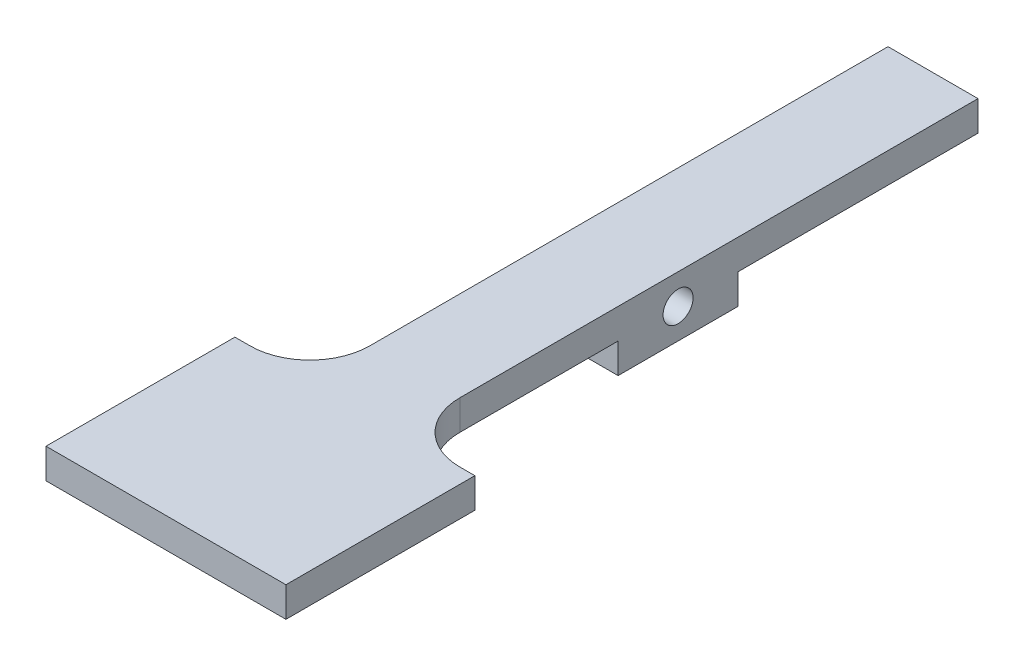
ISO-10303-21;
HEADER;
FILE_DESCRIPTION(('STEP AP214'),'2;1');
FILE_NAME('part.step','',(''),(''),'','','');
FILE_SCHEMA(('AUTOMOTIVE_DESIGN { 1 0 10303 214 1 1 1 1 }'));
ENDSEC;
DATA;
#1=APPLICATION_CONTEXT('core data for automotive mechanical design processes');
#2=APPLICATION_PROTOCOL_DEFINITION('international standard','automotive_design',2000,#1);
#3=PRODUCT_CONTEXT('',#1,'mechanical');
#4=PRODUCT('Part','Part','',(#3));
#5=PRODUCT_RELATED_PRODUCT_CATEGORY('part','',(#4));
#6=PRODUCT_DEFINITION_FORMATION('','',#4);
#7=PRODUCT_DEFINITION_CONTEXT('part definition',#1,'design');
#8=PRODUCT_DEFINITION('design','',#6,#7);
#9=PRODUCT_DEFINITION_SHAPE('','',#8);
#10=(LENGTH_UNIT() NAMED_UNIT(*) SI_UNIT(.MILLI.,.METRE.));
#11=(NAMED_UNIT(*) PLANE_ANGLE_UNIT() SI_UNIT($,.RADIAN.));
#12=(NAMED_UNIT(*) SI_UNIT($,.STERADIAN.) SOLID_ANGLE_UNIT());
#13=UNCERTAINTY_MEASURE_WITH_UNIT(LENGTH_MEASURE(1.E-05),#10,'distance_accuracy_value','');
#14=(GEOMETRIC_REPRESENTATION_CONTEXT(3) GLOBAL_UNCERTAINTY_ASSIGNED_CONTEXT((#13)) GLOBAL_UNIT_ASSIGNED_CONTEXT((#10,
#11,#12)) REPRESENTATION_CONTEXT('',''));
#15=CARTESIAN_POINT('',(0.,0.,0.));
#16=DIRECTION('',(0.,0.,1.));
#17=DIRECTION('',(1.,0.,0.));
#18=AXIS2_PLACEMENT_3D('',#15,#16,#17);
#19=CARTESIAN_POINT('',(9.525,0.,0.));
#20=DIRECTION('',(1.,0.,0.));
#21=DIRECTION('',(0.,0.,-1.));
#22=AXIS2_PLACEMENT_3D('',#19,#20,#21);
#23=PLANE('',#22);
#24=CARTESIAN_POINT('',(9.525,-1.5875,31.75));
#25=DIRECTION('',(1.,0.,0.));
#26=DIRECTION('',(0.,0.,-1.));
#27=AXIS2_PLACEMENT_3D('',#24,#25,#26);
#28=CIRCLE('',#27,1.5875);
#29=CARTESIAN_POINT('',(9.525,-1.5875,30.1625));
#30=VERTEX_POINT('',#29);
#31=EDGE_CURVE('E181',#30,#30,#28,.T.);
#32=ORIENTED_EDGE('',*,*,#31,.F.);
#33=EDGE_LOOP('',(#32));
#34=FACE_BOUND('',#33,.T.);
#35=DIRECTION('',(0.,0.,-1.));
#36=VECTOR('',#35,1.);
#37=CARTESIAN_POINT('',(9.525,1.5875,0.));
#38=LINE('',#37,#36);
#39=CARTESIAN_POINT('',(9.525,1.5875,54.85));
#40=VERTEX_POINT('',#39);
#41=CARTESIAN_POINT('',(9.525,1.5875,0.));
#42=VERTEX_POINT('',#41);
#43=EDGE_CURVE('E184',#40,#42,#38,.T.);
#44=ORIENTED_EDGE('',*,*,#43,.F.);
#45=DIRECTION('',(0.,-1.,0.));
#46=VECTOR('',#45,1.);
#47=CARTESIAN_POINT('',(9.525,0.,54.85));
#48=LINE('',#47,#46);
#49=CARTESIAN_POINT('',(9.525,-1.58750000000001,54.85));
#50=VERTEX_POINT('',#49);
#51=EDGE_CURVE('E240',#40,#50,#48,.T.);
#52=ORIENTED_EDGE('',*,*,#51,.T.);
#53=DIRECTION('',(0.,0.,1.));
#54=VECTOR('',#53,1.);
#55=CARTESIAN_POINT('',(9.525,-1.5875,0.));
#56=LINE('',#55,#54);
#57=CARTESIAN_POINT('',(9.525,-1.5875,38.1));
#58=VERTEX_POINT('',#57);
#59=EDGE_CURVE('E187',#58,#50,#56,.T.);
#60=ORIENTED_EDGE('',*,*,#59,.F.);
#61=DIRECTION('',(0.,-1.,0.));
#62=VECTOR('',#61,1.);
#63=CARTESIAN_POINT('',(9.525,0.,38.1));
#64=LINE('',#63,#62);
#65=CARTESIAN_POINT('',(9.525,-4.7625,38.1));
#66=VERTEX_POINT('',#65);
#67=EDGE_CURVE('E189',#58,#66,#64,.T.);
#68=ORIENTED_EDGE('',*,*,#67,.T.);
#69=DIRECTION('',(0.,0.,-1.));
#70=VECTOR('',#69,1.);
#71=CARTESIAN_POINT('',(9.525,-4.7625,0.));
#72=LINE('',#71,#70);
#73=CARTESIAN_POINT('',(9.525,-4.7625,25.4));
#74=VERTEX_POINT('',#73);
#75=EDGE_CURVE('E192',#66,#74,#72,.T.);
#76=ORIENTED_EDGE('',*,*,#75,.T.);
#77=DIRECTION('',(0.,-1.,0.));
#78=VECTOR('',#77,1.);
#79=CARTESIAN_POINT('',(9.525,0.,25.4));
#80=LINE('',#79,#78);
#81=CARTESIAN_POINT('',(9.525,-1.5875,25.4));
#82=VERTEX_POINT('',#81);
#83=EDGE_CURVE('E194',#82,#74,#80,.T.);
#84=ORIENTED_EDGE('',*,*,#83,.F.);
#85=DIRECTION('',(0.,0.,1.));
#86=VECTOR('',#85,1.);
#87=CARTESIAN_POINT('',(9.525,-1.5875,0.));
#88=LINE('',#87,#86);
#89=CARTESIAN_POINT('',(9.525,-1.5875,0.));
#90=VERTEX_POINT('',#89);
#91=EDGE_CURVE('E197',#90,#82,#88,.T.);
#92=ORIENTED_EDGE('',*,*,#91,.F.);
#93=DIRECTION('',(0.,-1.,0.));
#94=VECTOR('',#93,1.);
#95=CARTESIAN_POINT('',(9.525,0.,0.));
#96=LINE('',#95,#94);
#97=EDGE_CURVE('E200',#42,#90,#96,.T.);
#98=ORIENTED_EDGE('',*,*,#97,.F.);
#99=EDGE_LOOP('',(#44,#52,#60,#68,#76,#84,#92,#98));
#100=FACE_BOUND('',#99,.T.);
#101=ADVANCED_FACE('F48',(#34,#100),#23,.T.);
#102=CARTESIAN_POINT('',(0.,0.,0.));
#103=DIRECTION('',(1.,0.,0.));
#104=DIRECTION('',(0.,0.,-1.));
#105=AXIS2_PLACEMENT_3D('',#102,#103,#104);
#106=PLANE('',#105);
#107=CARTESIAN_POINT('',(0.,-1.5875,31.75));
#108=DIRECTION('',(1.,0.,0.));
#109=DIRECTION('',(0.,0.,-1.));
#110=AXIS2_PLACEMENT_3D('',#107,#108,#109);
#111=CIRCLE('',#110,1.5875);
#112=CARTESIAN_POINT('',(0.,-1.5875,30.1625));
#113=VERTEX_POINT('',#112);
#114=EDGE_CURVE('E172',#113,#113,#111,.T.);
#115=ORIENTED_EDGE('',*,*,#114,.T.);
#116=EDGE_LOOP('',(#115));
#117=FACE_BOUND('',#116,.T.);
#118=DIRECTION('',(0.,0.,1.));
#119=VECTOR('',#118,1.);
#120=CARTESIAN_POINT('',(0.,-1.5875,0.));
#121=LINE('',#120,#119);
#122=CARTESIAN_POINT('',(0.,-1.5875,38.1));
#123=VERTEX_POINT('',#122);
#124=CARTESIAN_POINT('',(0.,-1.58750000000001,54.85));
#125=VERTEX_POINT('',#124);
#126=EDGE_CURVE('E205',#123,#125,#121,.T.);
#127=ORIENTED_EDGE('',*,*,#126,.T.);
#128=DIRECTION('',(0.,-1.,0.));
#129=VECTOR('',#128,1.);
#130=CARTESIAN_POINT('',(0.,1.5875,54.85));
#131=LINE('',#130,#129);
#132=CARTESIAN_POINT('',(0.,1.5875,54.85));
#133=VERTEX_POINT('',#132);
#134=EDGE_CURVE('E238',#125,#133,#131,.F.);
#135=ORIENTED_EDGE('',*,*,#134,.T.);
#136=DIRECTION('',(0.,0.,-1.));
#137=VECTOR('',#136,1.);
#138=CARTESIAN_POINT('',(0.,1.5875,0.));
#139=LINE('',#138,#137);
#140=CARTESIAN_POINT('',(0.,1.5875,0.));
#141=VERTEX_POINT('',#140);
#142=EDGE_CURVE('E175',#133,#141,#139,.T.);
#143=ORIENTED_EDGE('',*,*,#142,.T.);
#144=DIRECTION('',(0.,-1.,0.));
#145=VECTOR('',#144,1.);
#146=CARTESIAN_POINT('',(0.,0.,0.));
#147=LINE('',#146,#145);
#148=CARTESIAN_POINT('',(0.,-1.5875,0.));
#149=VERTEX_POINT('',#148);
#150=EDGE_CURVE('E185',#141,#149,#147,.T.);
#151=ORIENTED_EDGE('',*,*,#150,.T.);
#152=DIRECTION('',(0.,0.,1.));
#153=VECTOR('',#152,1.);
#154=CARTESIAN_POINT('',(0.,-1.5875,0.));
#155=LINE('',#154,#153);
#156=CARTESIAN_POINT('',(0.,-1.5875,25.4));
#157=VERTEX_POINT('',#156);
#158=EDGE_CURVE('E217',#149,#157,#155,.T.);
#159=ORIENTED_EDGE('',*,*,#158,.T.);
#160=DIRECTION('',(0.,-1.,0.));
#161=VECTOR('',#160,1.);
#162=CARTESIAN_POINT('',(0.,0.,25.4));
#163=LINE('',#162,#161);
#164=CARTESIAN_POINT('',(0.,-4.7625,25.4));
#165=VERTEX_POINT('',#164);
#166=EDGE_CURVE('E214',#157,#165,#163,.T.);
#167=ORIENTED_EDGE('',*,*,#166,.T.);
#168=DIRECTION('',(0.,0.,-1.));
#169=VECTOR('',#168,1.);
#170=CARTESIAN_POINT('',(0.,-4.7625,0.));
#171=LINE('',#170,#169);
#172=CARTESIAN_POINT('',(0.,-4.7625,38.1));
#173=VERTEX_POINT('',#172);
#174=EDGE_CURVE('E211',#173,#165,#171,.T.);
#175=ORIENTED_EDGE('',*,*,#174,.F.);
#176=DIRECTION('',(0.,-1.,0.));
#177=VECTOR('',#176,1.);
#178=CARTESIAN_POINT('',(0.,0.,38.1));
#179=LINE('',#178,#177);
#180=EDGE_CURVE('E208',#123,#173,#179,.T.);
#181=ORIENTED_EDGE('',*,*,#180,.F.);
#182=EDGE_LOOP('',(#127,#135,#143,#151,#159,#167,#175,#181));
#183=FACE_BOUND('',#182,.T.);
#184=ADVANCED_FACE('F268',(#117,#183),#106,.F.);
#185=CARTESIAN_POINT('',(9.525,1.5875,0.));
#186=DIRECTION('',(0.,1.,0.));
#187=DIRECTION('',(0.,0.,1.));
#188=AXIS2_PLACEMENT_3D('',#185,#186,#187);
#189=PLANE('',#188);
#190=DIRECTION('',(-1.,0.,0.));
#191=VECTOR('',#190,1.);
#192=CARTESIAN_POINT('',(17.4625,1.5875,61.2));
#193=LINE('',#192,#191);
#194=CARTESIAN_POINT('',(17.4625,1.5875,61.2));
#195=VERTEX_POINT('',#194);
#196=CARTESIAN_POINT('',(15.875,1.5875,61.2));
#197=VERTEX_POINT('',#196);
#198=EDGE_CURVE('E259',#195,#197,#193,.T.);
#199=ORIENTED_EDGE('',*,*,#198,.T.);
#200=CARTESIAN_POINT('',(15.875,1.5875,54.85));
#201=DIRECTION('',(0.,1.,0.));
#202=DIRECTION('',(0.,0.,1.));
#203=AXIS2_PLACEMENT_3D('',#200,#201,#202);
#204=CIRCLE('',#203,6.35);
#205=EDGE_CURVE('E11',#197,#40,#204,.F.);
#206=ORIENTED_EDGE('',*,*,#205,.T.);
#207=ORIENTED_EDGE('',*,*,#43,.T.);
#208=DIRECTION('',(-1.,0.,0.));
#209=VECTOR('',#208,1.);
#210=CARTESIAN_POINT('',(9.525,1.5875,0.));
#211=LINE('',#210,#209);
#212=EDGE_CURVE('E202',#42,#141,#211,.T.);
#213=ORIENTED_EDGE('',*,*,#212,.T.);
#214=ORIENTED_EDGE('',*,*,#142,.F.);
#215=CARTESIAN_POINT('',(-6.35,1.5875,54.85));
#216=DIRECTION('',(0.,1.,0.));
#217=DIRECTION('',(0.,0.,1.));
#218=AXIS2_PLACEMENT_3D('',#215,#216,#217);
#219=CIRCLE('',#218,6.35);
#220=CARTESIAN_POINT('',(-6.35,1.5875,61.2));
#221=VERTEX_POINT('',#220);
#222=EDGE_CURVE('E246',#133,#221,#219,.F.);
#223=ORIENTED_EDGE('',*,*,#222,.T.);
#224=CARTESIAN_POINT('',(-7.9375,1.5875,61.2));
#225=VERTEX_POINT('',#224);
#226=EDGE_CURVE('E250',#221,#225,#193,.T.);
#227=ORIENTED_EDGE('',*,*,#226,.T.);
#228=DIRECTION('',(0.,0.,1.));
#229=VECTOR('',#228,1.);
#230=CARTESIAN_POINT('',(-7.9375,1.58750000000001,0.));
#231=LINE('',#230,#229);
#232=CARTESIAN_POINT('',(-7.9375,1.5875,81.2));
#233=VERTEX_POINT('',#232);
#234=EDGE_CURVE('E171',#225,#233,#231,.T.);
#235=ORIENTED_EDGE('',*,*,#234,.T.);
#236=DIRECTION('',(-1.,0.,0.));
#237=VECTOR('',#236,1.);
#238=CARTESIAN_POINT('',(17.4625,1.5875,81.2));
#239=LINE('',#238,#237);
#240=CARTESIAN_POINT('',(17.4625,1.5875,81.2));
#241=VERTEX_POINT('',#240);
#242=EDGE_CURVE('E153',#241,#233,#239,.T.);
#243=ORIENTED_EDGE('',*,*,#242,.F.);
#244=DIRECTION('',(0.,0.,1.));
#245=VECTOR('',#244,1.);
#246=CARTESIAN_POINT('',(17.4625,1.58750000000001,0.));
#247=LINE('',#246,#245);
#248=EDGE_CURVE('E160',#195,#241,#247,.T.);
#249=ORIENTED_EDGE('',*,*,#248,.F.);
#250=EDGE_LOOP('',(#199,#206,#207,#213,#214,#223,#227,#235,#243,#249));
#251=FACE_BOUND('',#250,.T.);
#252=ADVANCED_FACE('F169',(#251),#189,.T.);
#253=CARTESIAN_POINT('',(9.525,-1.5875,0.));
#254=DIRECTION('',(0.,-1.,0.));
#255=DIRECTION('',(0.,0.,-1.));
#256=AXIS2_PLACEMENT_3D('',#253,#254,#255);
#257=PLANE('',#256);
#258=DIRECTION('',(-1.,0.,0.));
#259=VECTOR('',#258,1.);
#260=CARTESIAN_POINT('',(17.4625,-1.5875,61.2));
#261=LINE('',#260,#259);
#262=CARTESIAN_POINT('',(-6.35,-1.5875,61.2));
#263=VERTEX_POINT('',#262);
#264=CARTESIAN_POINT('',(-7.9375,-1.5875,61.2));
#265=VERTEX_POINT('',#264);
#266=EDGE_CURVE('E265',#263,#265,#261,.T.);
#267=ORIENTED_EDGE('',*,*,#266,.F.);
#268=CARTESIAN_POINT('',(-6.35,-1.58750000000001,54.85));
#269=DIRECTION('',(0.,-1.,0.));
#270=DIRECTION('',(0.,0.,-1.));
#271=AXIS2_PLACEMENT_3D('',#268,#269,#270);
#272=CIRCLE('',#271,6.35);
#273=EDGE_CURVE('E244',#263,#125,#272,.F.);
#274=ORIENTED_EDGE('',*,*,#273,.T.);
#275=ORIENTED_EDGE('',*,*,#126,.F.);
#276=DIRECTION('',(-1.,0.,0.));
#277=VECTOR('',#276,1.);
#278=CARTESIAN_POINT('',(9.525,-1.5875,38.1));
#279=LINE('',#278,#277);
#280=EDGE_CURVE('E233',#58,#123,#279,.T.);
#281=ORIENTED_EDGE('',*,*,#280,.F.);
#282=ORIENTED_EDGE('',*,*,#59,.T.);
#283=CARTESIAN_POINT('',(15.875,-1.58750000000001,54.85));
#284=DIRECTION('',(0.,-1.,0.));
#285=DIRECTION('',(0.,0.,-1.));
#286=AXIS2_PLACEMENT_3D('',#283,#284,#285);
#287=CIRCLE('',#286,6.35);
#288=CARTESIAN_POINT('',(15.875,-1.5875,61.2));
#289=VERTEX_POINT('',#288);
#290=EDGE_CURVE('E56',#50,#289,#287,.F.);
#291=ORIENTED_EDGE('',*,*,#290,.T.);
#292=CARTESIAN_POINT('',(17.4625,-1.5875,61.2));
#293=VERTEX_POINT('',#292);
#294=EDGE_CURVE('E177',#293,#289,#261,.T.);
#295=ORIENTED_EDGE('',*,*,#294,.F.);
#296=DIRECTION('',(0.,0.,-1.));
#297=VECTOR('',#296,1.);
#298=CARTESIAN_POINT('',(17.4625,-1.5875,0.));
#299=LINE('',#298,#297);
#300=CARTESIAN_POINT('',(17.4625,-1.58750000000001,81.2));
#301=VERTEX_POINT('',#300);
#302=EDGE_CURVE('E159',#301,#293,#299,.T.);
#303=ORIENTED_EDGE('',*,*,#302,.F.);
#304=DIRECTION('',(-1.,0.,0.));
#305=VECTOR('',#304,1.);
#306=CARTESIAN_POINT('',(17.4625,-1.58750000000001,81.2));
#307=LINE('',#306,#305);
#308=CARTESIAN_POINT('',(-7.9375,-1.58750000000001,81.2));
#309=VERTEX_POINT('',#308);
#310=EDGE_CURVE('E156',#301,#309,#307,.T.);
#311=ORIENTED_EDGE('',*,*,#310,.T.);
#312=DIRECTION('',(0.,0.,-1.));
#313=VECTOR('',#312,1.);
#314=CARTESIAN_POINT('',(-7.9375,-1.5875,0.));
#315=LINE('',#314,#313);
#316=EDGE_CURVE('E290',#309,#265,#315,.T.);
#317=ORIENTED_EDGE('',*,*,#316,.T.);
#318=EDGE_LOOP('',(#267,#274,#275,#281,#282,#291,#295,#303,#311,#317));
#319=FACE_BOUND('',#318,.T.);
#320=ADVANCED_FACE('F263',(#319),#257,.T.);
#321=CARTESIAN_POINT('',(9.525,0.,38.1));
#322=DIRECTION('',(0.,0.,-1.));
#323=DIRECTION('',(-1.,0.,0.));
#324=AXIS2_PLACEMENT_3D('',#321,#322,#323);
#325=PLANE('',#324);
#326=ORIENTED_EDGE('',*,*,#180,.T.);
#327=DIRECTION('',(-1.,0.,0.));
#328=VECTOR('',#327,1.);
#329=CARTESIAN_POINT('',(9.525,-4.7625,38.1));
#330=LINE('',#329,#328);
#331=EDGE_CURVE('E230',#66,#173,#330,.T.);
#332=ORIENTED_EDGE('',*,*,#331,.F.);
#333=ORIENTED_EDGE('',*,*,#67,.F.);
#334=ORIENTED_EDGE('',*,*,#280,.T.);
#335=EDGE_LOOP('',(#326,#332,#333,#334));
#336=FACE_BOUND('',#335,.T.);
#337=ADVANCED_FACE('F271',(#336),#325,.F.);
#338=CARTESIAN_POINT('',(9.525,-4.7625,0.));
#339=DIRECTION('',(0.,1.,0.));
#340=DIRECTION('',(0.,0.,1.));
#341=AXIS2_PLACEMENT_3D('',#338,#339,#340);
#342=PLANE('',#341);
#343=ORIENTED_EDGE('',*,*,#174,.T.);
#344=DIRECTION('',(-1.,0.,0.));
#345=VECTOR('',#344,1.);
#346=CARTESIAN_POINT('',(9.525,-4.7625,25.4));
#347=LINE('',#346,#345);
#348=EDGE_CURVE('E228',#74,#165,#347,.T.);
#349=ORIENTED_EDGE('',*,*,#348,.F.);
#350=ORIENTED_EDGE('',*,*,#75,.F.);
#351=ORIENTED_EDGE('',*,*,#331,.T.);
#352=EDGE_LOOP('',(#343,#349,#350,#351));
#353=FACE_BOUND('',#352,.T.);
#354=ADVANCED_FACE('F324',(#353),#342,.F.);
#355=CARTESIAN_POINT('',(9.525,0.,25.4));
#356=DIRECTION('',(0.,0.,-1.));
#357=DIRECTION('',(-1.,0.,0.));
#358=AXIS2_PLACEMENT_3D('',#355,#356,#357);
#359=PLANE('',#358);
#360=ORIENTED_EDGE('',*,*,#166,.F.);
#361=DIRECTION('',(-1.,0.,0.));
#362=VECTOR('',#361,1.);
#363=CARTESIAN_POINT('',(9.525,-1.5875,25.4));
#364=LINE('',#363,#362);
#365=EDGE_CURVE('E226',#82,#157,#364,.T.);
#366=ORIENTED_EDGE('',*,*,#365,.F.);
#367=ORIENTED_EDGE('',*,*,#83,.T.);
#368=ORIENTED_EDGE('',*,*,#348,.T.);
#369=EDGE_LOOP('',(#360,#366,#367,#368));
#370=FACE_BOUND('',#369,.T.);
#371=ADVANCED_FACE('F320',(#370),#359,.T.);
#372=CARTESIAN_POINT('',(9.525,-1.5875,0.));
#373=DIRECTION('',(0.,-1.,0.));
#374=DIRECTION('',(0.,0.,-1.));
#375=AXIS2_PLACEMENT_3D('',#372,#373,#374);
#376=PLANE('',#375);
#377=ORIENTED_EDGE('',*,*,#158,.F.);
#378=DIRECTION('',(-1.,0.,0.));
#379=VECTOR('',#378,1.);
#380=CARTESIAN_POINT('',(9.525,-1.5875,0.));
#381=LINE('',#380,#379);
#382=EDGE_CURVE('E224',#90,#149,#381,.T.);
#383=ORIENTED_EDGE('',*,*,#382,.F.);
#384=ORIENTED_EDGE('',*,*,#91,.T.);
#385=ORIENTED_EDGE('',*,*,#365,.T.);
#386=EDGE_LOOP('',(#377,#383,#384,#385));
#387=FACE_BOUND('',#386,.T.);
#388=ADVANCED_FACE('F317',(#387),#376,.T.);
#389=CARTESIAN_POINT('',(9.525,-1.5875,31.75));
#390=DIRECTION('',(-1.,0.,0.));
#391=DIRECTION('',(0.,0.,1.));
#392=AXIS2_PLACEMENT_3D('',#389,#390,#391);
#393=CYLINDRICAL_SURFACE('',#392,1.5875);
#394=ORIENTED_EDGE('',*,*,#31,.T.);
#395=EDGE_LOOP('',(#394));
#396=FACE_BOUND('',#395,.T.);
#397=ORIENTED_EDGE('',*,*,#114,.F.);
#398=EDGE_LOOP('',(#397));
#399=FACE_BOUND('',#398,.T.);
#400=ADVANCED_FACE('F315',(#396,#399),#393,.F.);
#401=CARTESIAN_POINT('',(9.525,0.,0.));
#402=DIRECTION('',(0.,0.,-1.));
#403=DIRECTION('',(0.,1.,0.));
#404=AXIS2_PLACEMENT_3D('',#401,#402,#403);
#405=PLANE('',#404);
#406=ORIENTED_EDGE('',*,*,#150,.F.);
#407=ORIENTED_EDGE('',*,*,#212,.F.);
#408=ORIENTED_EDGE('',*,*,#97,.T.);
#409=ORIENTED_EDGE('',*,*,#382,.T.);
#410=EDGE_LOOP('',(#406,#407,#408,#409));
#411=FACE_BOUND('',#410,.T.);
#412=ADVANCED_FACE('F312',(#411),#405,.T.);
#413=CARTESIAN_POINT('',(17.4625,0.,61.2));
#414=DIRECTION('',(0.,0.,1.));
#415=DIRECTION('',(1.,0.,0.));
#416=AXIS2_PLACEMENT_3D('',#413,#414,#415);
#417=PLANE('',#416);
#418=ORIENTED_EDGE('',*,*,#226,.F.);
#419=DIRECTION('',(0.,-1.,0.));
#420=VECTOR('',#419,1.);
#421=CARTESIAN_POINT('',(-6.35,-1.5875,61.2));
#422=LINE('',#421,#420);
#423=EDGE_CURVE('E235',#221,#263,#422,.T.);
#424=ORIENTED_EDGE('',*,*,#423,.T.);
#425=ORIENTED_EDGE('',*,*,#266,.T.);
#426=DIRECTION('',(0.,1.,0.));
#427=VECTOR('',#426,1.);
#428=CARTESIAN_POINT('',(-7.9375,0.,61.2));
#429=LINE('',#428,#427);
#430=EDGE_CURVE('E167',#265,#225,#429,.T.);
#431=ORIENTED_EDGE('',*,*,#430,.T.);
#432=EDGE_LOOP('',(#418,#424,#425,#431));
#433=FACE_BOUND('',#432,.T.);
#434=ADVANCED_FACE('F256',(#433),#417,.F.);
#435=CARTESIAN_POINT('',(17.4625,0.,81.2));
#436=DIRECTION('',(0.,0.,-1.));
#437=DIRECTION('',(-1.,0.,0.));
#438=AXIS2_PLACEMENT_3D('',#435,#436,#437);
#439=PLANE('',#438);
#440=DIRECTION('',(0.,-1.,0.));
#441=VECTOR('',#440,1.);
#442=CARTESIAN_POINT('',(-7.9375,0.,81.2));
#443=LINE('',#442,#441);
#444=EDGE_CURVE('E289',#233,#309,#443,.T.);
#445=ORIENTED_EDGE('',*,*,#444,.T.);
#446=ORIENTED_EDGE('',*,*,#310,.F.);
#447=DIRECTION('',(0.,-1.,0.));
#448=VECTOR('',#447,1.);
#449=CARTESIAN_POINT('',(17.4625,0.,81.2));
#450=LINE('',#449,#448);
#451=EDGE_CURVE('E149',#241,#301,#450,.T.);
#452=ORIENTED_EDGE('',*,*,#451,.F.);
#453=ORIENTED_EDGE('',*,*,#242,.T.);
#454=EDGE_LOOP('',(#445,#446,#452,#453));
#455=FACE_BOUND('',#454,.T.);
#456=ADVANCED_FACE('F151',(#455),#439,.F.);
#457=ORIENTED_EDGE('',*,*,#294,.T.);
#458=DIRECTION('',(0.,-1.,0.));
#459=VECTOR('',#458,1.);
#460=CARTESIAN_POINT('',(15.875,0.,61.2));
#461=LINE('',#460,#459);
#462=EDGE_CURVE('E69',#289,#197,#461,.F.);
#463=ORIENTED_EDGE('',*,*,#462,.T.);
#464=ORIENTED_EDGE('',*,*,#198,.F.);
#465=DIRECTION('',(0.,1.,0.));
#466=VECTOR('',#465,1.);
#467=CARTESIAN_POINT('',(17.4625,0.,61.2));
#468=LINE('',#467,#466);
#469=EDGE_CURVE('E165',#293,#195,#468,.T.);
#470=ORIENTED_EDGE('',*,*,#469,.F.);
#471=EDGE_LOOP('',(#457,#463,#464,#470));
#472=FACE_BOUND('',#471,.T.);
#473=ADVANCED_FACE('F283',(#472),#417,.F.);
#474=CARTESIAN_POINT('',(17.4625,0.,0.));
#475=DIRECTION('',(1.,0.,0.));
#476=DIRECTION('',(0.,0.,-1.));
#477=AXIS2_PLACEMENT_3D('',#474,#475,#476);
#478=PLANE('',#477);
#479=ORIENTED_EDGE('',*,*,#248,.T.);
#480=ORIENTED_EDGE('',*,*,#451,.T.);
#481=ORIENTED_EDGE('',*,*,#302,.T.);
#482=ORIENTED_EDGE('',*,*,#469,.T.);
#483=EDGE_LOOP('',(#479,#480,#481,#482));
#484=FACE_BOUND('',#483,.T.);
#485=ADVANCED_FACE('F163',(#484),#478,.T.);
#486=CARTESIAN_POINT('',(-7.9375,0.,0.));
#487=DIRECTION('',(1.,0.,0.));
#488=DIRECTION('',(0.,0.,-1.));
#489=AXIS2_PLACEMENT_3D('',#486,#487,#488);
#490=PLANE('',#489);
#491=ORIENTED_EDGE('',*,*,#234,.F.);
#492=ORIENTED_EDGE('',*,*,#430,.F.);
#493=ORIENTED_EDGE('',*,*,#316,.F.);
#494=ORIENTED_EDGE('',*,*,#444,.F.);
#495=EDGE_LOOP('',(#491,#492,#493,#494));
#496=FACE_BOUND('',#495,.T.);
#497=ADVANCED_FACE('F292',(#496),#490,.F.);
#498=CARTESIAN_POINT('',(-6.35,0.,54.85));
#499=DIRECTION('',(0.,1.,0.));
#500=DIRECTION('',(0.,0.,1.));
#501=AXIS2_PLACEMENT_3D('',#498,#499,#500);
#502=CYLINDRICAL_SURFACE('',#501,6.35);
#503=ORIENTED_EDGE('',*,*,#222,.F.);
#504=ORIENTED_EDGE('',*,*,#134,.F.);
#505=ORIENTED_EDGE('',*,*,#273,.F.);
#506=ORIENTED_EDGE('',*,*,#423,.F.);
#507=EDGE_LOOP('',(#503,#504,#505,#506));
#508=FACE_BOUND('',#507,.T.);
#509=ADVANCED_FACE('F261',(#508),#502,.F.);
#510=CARTESIAN_POINT('',(15.875,0.,54.85));
#511=DIRECTION('',(0.,-1.,0.));
#512=DIRECTION('',(0.,0.,-1.));
#513=AXIS2_PLACEMENT_3D('',#510,#511,#512);
#514=CYLINDRICAL_SURFACE('',#513,6.35);
#515=ORIENTED_EDGE('',*,*,#205,.F.);
#516=ORIENTED_EDGE('',*,*,#462,.F.);
#517=ORIENTED_EDGE('',*,*,#290,.F.);
#518=ORIENTED_EDGE('',*,*,#51,.F.);
#519=EDGE_LOOP('',(#515,#516,#517,#518));
#520=FACE_BOUND('',#519,.T.);
#521=ADVANCED_FACE('F50',(#520),#514,.F.);
#522=CLOSED_SHELL('',(#101,#184,#252,#320,#337,#354,#371,#388,#400,#412,#434,#456,#473,#485,
#497,#509,#521));
#523=MANIFOLD_SOLID_BREP('B2',#522);
#524=ADVANCED_BREP_SHAPE_REPRESENTATION('',(#18,#523),#14);
#525=SHAPE_DEFINITION_REPRESENTATION(#9,#524);
ENDSEC;
END-ISO-10303-21;
